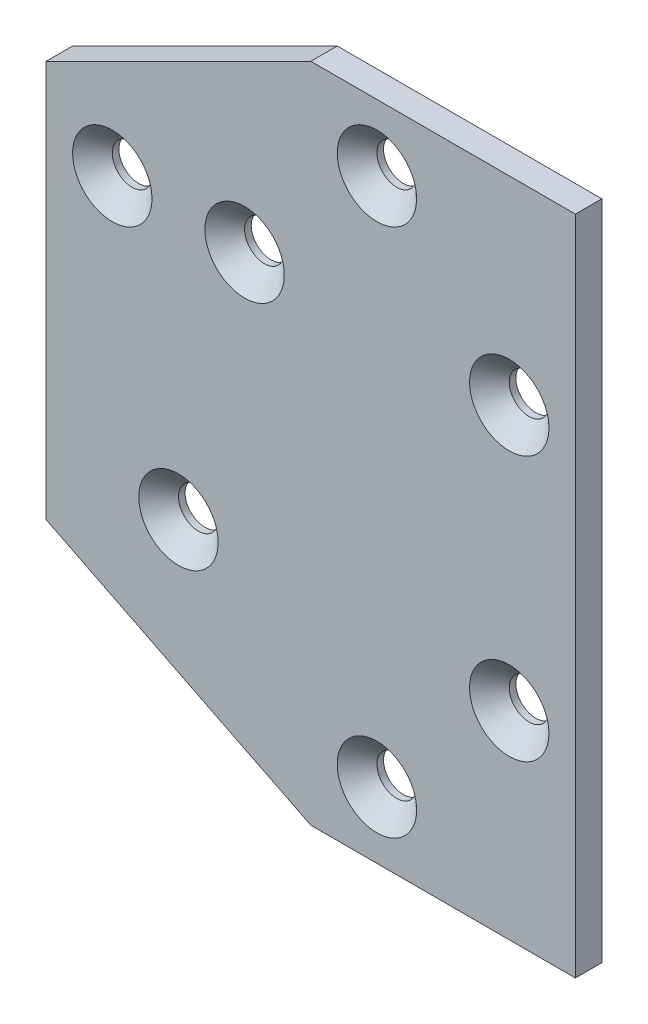
ISO-10303-21;
HEADER;
FILE_DESCRIPTION(('STEP AP214'),'2;1');
FILE_NAME('part.step','',(''),(''),'','','');
FILE_SCHEMA(('AUTOMOTIVE_DESIGN { 1 0 10303 214 1 1 1 1 }'));
ENDSEC;
DATA;
#1=APPLICATION_CONTEXT('core data for automotive mechanical design processes');
#2=APPLICATION_PROTOCOL_DEFINITION('international standard','automotive_design',2000,#1);
#3=PRODUCT_CONTEXT('',#1,'mechanical');
#4=PRODUCT('Part','Part','',(#3));
#5=PRODUCT_RELATED_PRODUCT_CATEGORY('part','',(#4));
#6=PRODUCT_DEFINITION_FORMATION('','',#4);
#7=PRODUCT_DEFINITION_CONTEXT('part definition',#1,'design');
#8=PRODUCT_DEFINITION('design','',#6,#7);
#9=PRODUCT_DEFINITION_SHAPE('','',#8);
#10=(LENGTH_UNIT() NAMED_UNIT(*) SI_UNIT(.MILLI.,.METRE.));
#11=(NAMED_UNIT(*) PLANE_ANGLE_UNIT() SI_UNIT($,.RADIAN.));
#12=(NAMED_UNIT(*) SI_UNIT($,.STERADIAN.) SOLID_ANGLE_UNIT());
#13=UNCERTAINTY_MEASURE_WITH_UNIT(LENGTH_MEASURE(1.E-05),#10,'distance_accuracy_value','');
#14=(GEOMETRIC_REPRESENTATION_CONTEXT(3) GLOBAL_UNCERTAINTY_ASSIGNED_CONTEXT((#13)) GLOBAL_UNIT_ASSIGNED_CONTEXT((#10,
#11,#12)) REPRESENTATION_CONTEXT('',''));
#15=CARTESIAN_POINT('',(0.,0.,0.));
#16=DIRECTION('',(0.,0.,1.));
#17=DIRECTION('',(1.,0.,0.));
#18=AXIS2_PLACEMENT_3D('',#15,#16,#17);
#19=CARTESIAN_POINT('',(120.,-50.,2.));
#20=DIRECTION('',(0.,1.,0.));
#21=DIRECTION('',(0.,0.,1.));
#22=AXIS2_PLACEMENT_3D('',#19,#20,#21);
#23=PLANE('',#22);
#24=DIRECTION('',(-1.,0.,0.));
#25=VECTOR('',#24,1.);
#26=CARTESIAN_POINT('',(120.,-50.,-2.));
#27=LINE('',#26,#25);
#28=CARTESIAN_POINT('',(140.,-50.,-2.));
#29=VERTEX_POINT('',#28);
#30=CARTESIAN_POINT('',(100.,-50.,-2.));
#31=VERTEX_POINT('',#30);
#32=EDGE_CURVE('E127',#29,#31,#27,.T.);
#33=ORIENTED_EDGE('',*,*,#32,.F.);
#34=DIRECTION('',(0.,0.,-1.));
#35=VECTOR('',#34,1.);
#36=CARTESIAN_POINT('',(140.,-50.,2.));
#37=LINE('',#36,#35);
#38=CARTESIAN_POINT('',(140.,-50.,2.));
#39=VERTEX_POINT('',#38);
#40=EDGE_CURVE('E126',#39,#29,#37,.T.);
#41=ORIENTED_EDGE('',*,*,#40,.F.);
#42=DIRECTION('',(-1.,0.,0.));
#43=VECTOR('',#42,1.);
#44=CARTESIAN_POINT('',(120.,-50.,2.));
#45=LINE('',#44,#43);
#46=CARTESIAN_POINT('',(100.,-50.,2.));
#47=VERTEX_POINT('',#46);
#48=EDGE_CURVE('E140',#39,#47,#45,.T.);
#49=ORIENTED_EDGE('',*,*,#48,.T.);
#50=DIRECTION('',(0.,0.,-1.));
#51=VECTOR('',#50,1.);
#52=CARTESIAN_POINT('',(100.,-50.,2.));
#53=LINE('',#52,#51);
#54=EDGE_CURVE('E147',#47,#31,#53,.T.);
#55=ORIENTED_EDGE('',*,*,#54,.T.);
#56=EDGE_LOOP('',(#33,#41,#49,#55));
#57=FACE_BOUND('',#56,.T.);
#58=ADVANCED_FACE('F43',(#57),#23,.F.);
#59=CARTESIAN_POINT('',(96.,-48.,2.));
#60=DIRECTION('',(0.447213595499958,0.894427190999916,0.));
#61=DIRECTION('',(0.894427190999916,-0.447213595499958,0.));
#62=AXIS2_PLACEMENT_3D('',#59,#60,#61);
#63=PLANE('',#62);
#64=DIRECTION('',(-0.894427190999916,0.447213595499958,0.));
#65=VECTOR('',#64,1.);
#66=CARTESIAN_POINT('',(96.,-48.,-2.));
#67=LINE('',#66,#65);
#68=CARTESIAN_POINT('',(60.,-30.,-2.));
#69=VERTEX_POINT('',#68);
#70=EDGE_CURVE('E129',#31,#69,#67,.T.);
#71=ORIENTED_EDGE('',*,*,#70,.F.);
#72=ORIENTED_EDGE('',*,*,#54,.F.);
#73=DIRECTION('',(-0.894427190999916,0.447213595499958,0.));
#74=VECTOR('',#73,1.);
#75=CARTESIAN_POINT('',(96.,-48.,2.));
#76=LINE('',#75,#74);
#77=CARTESIAN_POINT('',(60.,-30.,2.));
#78=VERTEX_POINT('',#77);
#79=EDGE_CURVE('E92',#47,#78,#76,.T.);
#80=ORIENTED_EDGE('',*,*,#79,.T.);
#81=DIRECTION('',(0.,0.,-1.));
#82=VECTOR('',#81,1.);
#83=CARTESIAN_POINT('',(60.,-30.,2.));
#84=LINE('',#83,#82);
#85=EDGE_CURVE('E144',#78,#69,#84,.T.);
#86=ORIENTED_EDGE('',*,*,#85,.T.);
#87=EDGE_LOOP('',(#71,#72,#80,#86));
#88=FACE_BOUND('',#87,.T.);
#89=ADVANCED_FACE('F213',(#88),#63,.F.);
#90=CARTESIAN_POINT('',(60.,0.,2.));
#91=DIRECTION('',(1.,0.,0.));
#92=DIRECTION('',(0.,0.,1.));
#93=AXIS2_PLACEMENT_3D('',#90,#91,#92);
#94=PLANE('',#93);
#95=DIRECTION('',(0.,1.,0.));
#96=VECTOR('',#95,1.);
#97=CARTESIAN_POINT('',(60.,0.,-2.));
#98=LINE('',#97,#96);
#99=CARTESIAN_POINT('',(60.,30.,-2.));
#100=VERTEX_POINT('',#99);
#101=EDGE_CURVE('E133',#69,#100,#98,.T.);
#102=ORIENTED_EDGE('',*,*,#101,.F.);
#103=ORIENTED_EDGE('',*,*,#85,.F.);
#104=DIRECTION('',(0.,1.,0.));
#105=VECTOR('',#104,1.);
#106=CARTESIAN_POINT('',(60.,0.,2.));
#107=LINE('',#106,#105);
#108=CARTESIAN_POINT('',(60.,30.,2.));
#109=VERTEX_POINT('',#108);
#110=EDGE_CURVE('E120',#78,#109,#107,.T.);
#111=ORIENTED_EDGE('',*,*,#110,.T.);
#112=DIRECTION('',(0.,0.,-1.));
#113=VECTOR('',#112,1.);
#114=CARTESIAN_POINT('',(60.,30.,2.));
#115=LINE('',#114,#113);
#116=EDGE_CURVE('E114',#109,#100,#115,.T.);
#117=ORIENTED_EDGE('',*,*,#116,.T.);
#118=EDGE_LOOP('',(#102,#103,#111,#117));
#119=FACE_BOUND('',#118,.T.);
#120=ADVANCED_FACE('F235',(#119),#94,.F.);
#121=CARTESIAN_POINT('',(96.,48.,2.));
#122=DIRECTION('',(-0.447213595499958,0.894427190999916,0.));
#123=DIRECTION('',(0.894427190999916,0.447213595499958,0.));
#124=AXIS2_PLACEMENT_3D('',#121,#122,#123);
#125=PLANE('',#124);
#126=DIRECTION('',(-0.894427190999916,-0.447213595499958,0.));
#127=VECTOR('',#126,1.);
#128=CARTESIAN_POINT('',(96.,48.,-2.));
#129=LINE('',#128,#127);
#130=CARTESIAN_POINT('',(100.,50.,-2.));
#131=VERTEX_POINT('',#130);
#132=EDGE_CURVE('E136',#131,#100,#129,.T.);
#133=ORIENTED_EDGE('',*,*,#132,.T.);
#134=ORIENTED_EDGE('',*,*,#116,.F.);
#135=DIRECTION('',(-0.894427190999916,-0.447213595499958,0.));
#136=VECTOR('',#135,1.);
#137=CARTESIAN_POINT('',(96.,48.,2.));
#138=LINE('',#137,#136);
#139=CARTESIAN_POINT('',(100.,50.,2.));
#140=VERTEX_POINT('',#139);
#141=EDGE_CURVE('E104',#140,#109,#138,.T.);
#142=ORIENTED_EDGE('',*,*,#141,.F.);
#143=DIRECTION('',(0.,0.,-1.));
#144=VECTOR('',#143,1.);
#145=CARTESIAN_POINT('',(100.,50.,2.));
#146=LINE('',#145,#144);
#147=EDGE_CURVE('E109',#140,#131,#146,.T.);
#148=ORIENTED_EDGE('',*,*,#147,.T.);
#149=EDGE_LOOP('',(#133,#134,#142,#148));
#150=FACE_BOUND('',#149,.T.);
#151=ADVANCED_FACE('F117',(#150),#125,.T.);
#152=CARTESIAN_POINT('',(120.,50.,2.));
#153=DIRECTION('',(0.,1.,0.));
#154=DIRECTION('',(0.,0.,1.));
#155=AXIS2_PLACEMENT_3D('',#152,#153,#154);
#156=PLANE('',#155);
#157=DIRECTION('',(-1.,0.,0.));
#158=VECTOR('',#157,1.);
#159=CARTESIAN_POINT('',(120.,50.,-2.));
#160=LINE('',#159,#158);
#161=CARTESIAN_POINT('',(140.,50.,-2.));
#162=VERTEX_POINT('',#161);
#163=EDGE_CURVE('E111',#162,#131,#160,.T.);
#164=ORIENTED_EDGE('',*,*,#163,.T.);
#165=ORIENTED_EDGE('',*,*,#147,.F.);
#166=DIRECTION('',(-1.,0.,0.));
#167=VECTOR('',#166,1.);
#168=CARTESIAN_POINT('',(120.,50.,2.));
#169=LINE('',#168,#167);
#170=CARTESIAN_POINT('',(140.,50.,2.));
#171=VERTEX_POINT('',#170);
#172=EDGE_CURVE('E100',#171,#140,#169,.T.);
#173=ORIENTED_EDGE('',*,*,#172,.F.);
#174=DIRECTION('',(0.,0.,-1.));
#175=VECTOR('',#174,1.);
#176=CARTESIAN_POINT('',(140.,50.,2.));
#177=LINE('',#176,#175);
#178=EDGE_CURVE('E115',#171,#162,#177,.T.);
#179=ORIENTED_EDGE('',*,*,#178,.T.);
#180=EDGE_LOOP('',(#164,#165,#173,#179));
#181=FACE_BOUND('',#180,.T.);
#182=ADVANCED_FACE('F110',(#181),#156,.T.);
#183=CARTESIAN_POINT('',(140.,0.,2.));
#184=DIRECTION('',(1.,0.,0.));
#185=DIRECTION('',(0.,0.,1.));
#186=AXIS2_PLACEMENT_3D('',#183,#184,#185);
#187=PLANE('',#186);
#188=DIRECTION('',(0.,1.,0.));
#189=VECTOR('',#188,1.);
#190=CARTESIAN_POINT('',(140.,0.,-2.));
#191=LINE('',#190,#189);
#192=EDGE_CURVE('E80',#29,#162,#191,.T.);
#193=ORIENTED_EDGE('',*,*,#192,.T.);
#194=ORIENTED_EDGE('',*,*,#178,.F.);
#195=DIRECTION('',(0.,1.,0.));
#196=VECTOR('',#195,1.);
#197=CARTESIAN_POINT('',(140.,0.,2.));
#198=LINE('',#197,#196);
#199=EDGE_CURVE('E60',#39,#171,#198,.T.);
#200=ORIENTED_EDGE('',*,*,#199,.F.);
#201=ORIENTED_EDGE('',*,*,#40,.T.);
#202=EDGE_LOOP('',(#193,#194,#200,#201));
#203=FACE_BOUND('',#202,.T.);
#204=ADVANCED_FACE('F218',(#203),#187,.T.);
#205=CARTESIAN_POINT('',(120.,0.,2.));
#206=DIRECTION('',(0.,0.,1.));
#207=DIRECTION('',(-1.,0.,0.));
#208=AXIS2_PLACEMENT_3D('',#205,#206,#207);
#209=PLANE('',#208);
#210=CARTESIAN_POINT('',(110.,-40.,2.));
#211=DIRECTION('',(0.,0.,-1.));
#212=DIRECTION('',(-1.,0.,0.));
#213=AXIS2_PLACEMENT_3D('',#210,#211,#212);
#214=CIRCLE('',#213,6.00000000000001);
#215=CARTESIAN_POINT('',(104.,-40.,2.));
#216=VERTEX_POINT('',#215);
#217=EDGE_CURVE('E171',#216,#216,#214,.F.);
#218=ORIENTED_EDGE('',*,*,#217,.F.);
#219=EDGE_LOOP('',(#218));
#220=FACE_BOUND('',#219,.T.);
#221=CARTESIAN_POINT('',(80.,-20.,2.));
#222=DIRECTION('',(0.,0.,-1.));
#223=DIRECTION('',(-1.,0.,0.));
#224=AXIS2_PLACEMENT_3D('',#221,#222,#223);
#225=CIRCLE('',#224,6.00000000000001);
#226=CARTESIAN_POINT('',(74.,-20.,2.));
#227=VERTEX_POINT('',#226);
#228=EDGE_CURVE('E168',#227,#227,#225,.F.);
#229=ORIENTED_EDGE('',*,*,#228,.F.);
#230=EDGE_LOOP('',(#229));
#231=FACE_BOUND('',#230,.T.);
#232=CARTESIAN_POINT('',(130.,-20.,2.));
#233=DIRECTION('',(0.,0.,-1.));
#234=DIRECTION('',(-1.,0.,0.));
#235=AXIS2_PLACEMENT_3D('',#232,#233,#234);
#236=CIRCLE('',#235,6.00000000000001);
#237=CARTESIAN_POINT('',(124.,-20.,2.));
#238=VERTEX_POINT('',#237);
#239=EDGE_CURVE('E165',#238,#238,#236,.F.);
#240=ORIENTED_EDGE('',*,*,#239,.F.);
#241=EDGE_LOOP('',(#240));
#242=FACE_BOUND('',#241,.T.);
#243=CARTESIAN_POINT('',(70.,20.,2.));
#244=DIRECTION('',(0.,0.,-1.));
#245=DIRECTION('',(-1.,0.,0.));
#246=AXIS2_PLACEMENT_3D('',#243,#244,#245);
#247=CIRCLE('',#246,6.00000000000001);
#248=CARTESIAN_POINT('',(64.,20.,2.));
#249=VERTEX_POINT('',#248);
#250=EDGE_CURVE('E162',#249,#249,#247,.F.);
#251=ORIENTED_EDGE('',*,*,#250,.F.);
#252=EDGE_LOOP('',(#251));
#253=FACE_BOUND('',#252,.T.);
#254=CARTESIAN_POINT('',(90.,20.,2.));
#255=DIRECTION('',(0.,0.,-1.));
#256=DIRECTION('',(-1.,0.,0.));
#257=AXIS2_PLACEMENT_3D('',#254,#255,#256);
#258=CIRCLE('',#257,6.00000000000001);
#259=CARTESIAN_POINT('',(84.,20.,2.));
#260=VERTEX_POINT('',#259);
#261=EDGE_CURVE('E159',#260,#260,#258,.F.);
#262=ORIENTED_EDGE('',*,*,#261,.F.);
#263=EDGE_LOOP('',(#262));
#264=FACE_BOUND('',#263,.T.);
#265=CARTESIAN_POINT('',(110.,40.,2.));
#266=DIRECTION('',(0.,0.,-1.));
#267=DIRECTION('',(-1.,0.,0.));
#268=AXIS2_PLACEMENT_3D('',#265,#266,#267);
#269=CIRCLE('',#268,6.00000000000001);
#270=CARTESIAN_POINT('',(104.,40.,2.));
#271=VERTEX_POINT('',#270);
#272=EDGE_CURVE('E156',#271,#271,#269,.F.);
#273=ORIENTED_EDGE('',*,*,#272,.F.);
#274=EDGE_LOOP('',(#273));
#275=FACE_BOUND('',#274,.T.);
#276=CARTESIAN_POINT('',(130.,20.,2.));
#277=DIRECTION('',(0.,0.,-1.));
#278=DIRECTION('',(-1.,0.,0.));
#279=AXIS2_PLACEMENT_3D('',#276,#277,#278);
#280=CIRCLE('',#279,6.);
#281=CARTESIAN_POINT('',(124.,20.,2.));
#282=VERTEX_POINT('',#281);
#283=EDGE_CURVE('E153',#282,#282,#280,.F.);
#284=ORIENTED_EDGE('',*,*,#283,.F.);
#285=EDGE_LOOP('',(#284));
#286=FACE_BOUND('',#285,.T.);
#287=ORIENTED_EDGE('',*,*,#48,.F.);
#288=ORIENTED_EDGE('',*,*,#199,.T.);
#289=ORIENTED_EDGE('',*,*,#172,.T.);
#290=ORIENTED_EDGE('',*,*,#141,.T.);
#291=ORIENTED_EDGE('',*,*,#110,.F.);
#292=ORIENTED_EDGE('',*,*,#79,.F.);
#293=EDGE_LOOP('',(#287,#288,#289,#290,#291,#292));
#294=FACE_BOUND('',#293,.T.);
#295=ADVANCED_FACE('F102',(#220,#231,#242,#253,#264,#275,#286,#294),#209,.T.);
#296=CARTESIAN_POINT('',(120.,0.,-2.));
#297=DIRECTION('',(0.,0.,1.));
#298=DIRECTION('',(-1.,0.,0.));
#299=AXIS2_PLACEMENT_3D('',#296,#297,#298);
#300=PLANE('',#299);
#301=CARTESIAN_POINT('',(80.,-20.,-2.));
#302=DIRECTION('',(0.,0.,-1.));
#303=DIRECTION('',(-1.,0.,0.));
#304=AXIS2_PLACEMENT_3D('',#301,#302,#303);
#305=CIRCLE('',#304,3.);
#306=CARTESIAN_POINT('',(77.,-20.,-2.));
#307=VERTEX_POINT('',#306);
#308=EDGE_CURVE('E208',#307,#307,#305,.T.);
#309=ORIENTED_EDGE('',*,*,#308,.F.);
#310=EDGE_LOOP('',(#309));
#311=FACE_BOUND('',#310,.T.);
#312=CARTESIAN_POINT('',(110.,-40.,-2.));
#313=DIRECTION('',(0.,0.,-1.));
#314=DIRECTION('',(-1.,0.,0.));
#315=AXIS2_PLACEMENT_3D('',#312,#313,#314);
#316=CIRCLE('',#315,3.);
#317=CARTESIAN_POINT('',(107.,-40.,-2.));
#318=VERTEX_POINT('',#317);
#319=EDGE_CURVE('E205',#318,#318,#316,.T.);
#320=ORIENTED_EDGE('',*,*,#319,.F.);
#321=EDGE_LOOP('',(#320));
#322=FACE_BOUND('',#321,.T.);
#323=CARTESIAN_POINT('',(130.,-20.,-2.));
#324=DIRECTION('',(0.,0.,-1.));
#325=DIRECTION('',(-1.,0.,0.));
#326=AXIS2_PLACEMENT_3D('',#323,#324,#325);
#327=CIRCLE('',#326,3.);
#328=CARTESIAN_POINT('',(127.,-20.,-2.));
#329=VERTEX_POINT('',#328);
#330=EDGE_CURVE('E200',#329,#329,#327,.T.);
#331=ORIENTED_EDGE('',*,*,#330,.F.);
#332=EDGE_LOOP('',(#331));
#333=FACE_BOUND('',#332,.T.);
#334=CARTESIAN_POINT('',(110.,40.,-2.));
#335=DIRECTION('',(0.,0.,-1.));
#336=DIRECTION('',(-1.,0.,0.));
#337=AXIS2_PLACEMENT_3D('',#334,#335,#336);
#338=CIRCLE('',#337,3.);
#339=CARTESIAN_POINT('',(107.,40.,-2.));
#340=VERTEX_POINT('',#339);
#341=EDGE_CURVE('E198',#340,#340,#338,.T.);
#342=ORIENTED_EDGE('',*,*,#341,.F.);
#343=EDGE_LOOP('',(#342));
#344=FACE_BOUND('',#343,.T.);
#345=CARTESIAN_POINT('',(90.,20.,-2.));
#346=DIRECTION('',(0.,0.,-1.));
#347=DIRECTION('',(-1.,0.,0.));
#348=AXIS2_PLACEMENT_3D('',#345,#346,#347);
#349=CIRCLE('',#348,3.);
#350=CARTESIAN_POINT('',(87.,20.,-2.));
#351=VERTEX_POINT('',#350);
#352=EDGE_CURVE('E493',#351,#351,#349,.T.);
#353=ORIENTED_EDGE('',*,*,#352,.F.);
#354=EDGE_LOOP('',(#353));
#355=FACE_BOUND('',#354,.T.);
#356=CARTESIAN_POINT('',(70.,20.,-2.));
#357=DIRECTION('',(0.,0.,-1.));
#358=DIRECTION('',(-1.,0.,0.));
#359=AXIS2_PLACEMENT_3D('',#356,#357,#358);
#360=CIRCLE('',#359,3.);
#361=CARTESIAN_POINT('',(67.,20.,-2.));
#362=VERTEX_POINT('',#361);
#363=EDGE_CURVE('E496',#362,#362,#360,.T.);
#364=ORIENTED_EDGE('',*,*,#363,.F.);
#365=EDGE_LOOP('',(#364));
#366=FACE_BOUND('',#365,.T.);
#367=CARTESIAN_POINT('',(130.,20.,-2.));
#368=DIRECTION('',(0.,0.,-1.));
#369=DIRECTION('',(-1.,0.,0.));
#370=AXIS2_PLACEMENT_3D('',#367,#368,#369);
#371=CIRCLE('',#370,3.);
#372=CARTESIAN_POINT('',(127.,20.,-2.));
#373=VERTEX_POINT('',#372);
#374=EDGE_CURVE('E130',#373,#373,#371,.T.);
#375=ORIENTED_EDGE('',*,*,#374,.F.);
#376=EDGE_LOOP('',(#375));
#377=FACE_BOUND('',#376,.T.);
#378=ORIENTED_EDGE('',*,*,#32,.T.);
#379=ORIENTED_EDGE('',*,*,#70,.T.);
#380=ORIENTED_EDGE('',*,*,#101,.T.);
#381=ORIENTED_EDGE('',*,*,#132,.F.);
#382=ORIENTED_EDGE('',*,*,#163,.F.);
#383=ORIENTED_EDGE('',*,*,#192,.F.);
#384=EDGE_LOOP('',(#378,#379,#380,#381,#382,#383));
#385=FACE_BOUND('',#384,.T.);
#386=ADVANCED_FACE('F225',(#311,#322,#333,#344,#355,#366,#377,#385),#300,.F.);
#387=CARTESIAN_POINT('',(130.,20.,-2.));
#388=DIRECTION('',(0.,0.,1.));
#389=DIRECTION('',(-1.,0.,0.));
#390=AXIS2_PLACEMENT_3D('',#387,#388,#389);
#391=CYLINDRICAL_SURFACE('',#390,3.);
#392=CARTESIAN_POINT('',(130.,20.,-1.));
#393=DIRECTION('',(0.,0.,-1.));
#394=DIRECTION('',(-1.,0.,0.));
#395=AXIS2_PLACEMENT_3D('',#392,#393,#394);
#396=CIRCLE('',#395,3.);
#397=CARTESIAN_POINT('',(127.,20.,-1.));
#398=VERTEX_POINT('',#397);
#399=EDGE_CURVE('E11',#398,#398,#396,.T.);
#400=ORIENTED_EDGE('',*,*,#399,.F.);
#401=EDGE_LOOP('',(#400));
#402=FACE_BOUND('',#401,.T.);
#403=ORIENTED_EDGE('',*,*,#374,.T.);
#404=EDGE_LOOP('',(#403));
#405=FACE_BOUND('',#404,.T.);
#406=ADVANCED_FACE('F272',(#402,#405),#391,.F.);
#407=CARTESIAN_POINT('',(70.,20.,-2.));
#408=DIRECTION('',(0.,0.,1.));
#409=DIRECTION('',(-1.,0.,0.));
#410=AXIS2_PLACEMENT_3D('',#407,#408,#409);
#411=CYLINDRICAL_SURFACE('',#410,3.);
#412=CARTESIAN_POINT('',(70.,20.,-1.));
#413=DIRECTION('',(0.,0.,-1.));
#414=DIRECTION('',(-1.,0.,0.));
#415=AXIS2_PLACEMENT_3D('',#412,#413,#414);
#416=CIRCLE('',#415,3.);
#417=CARTESIAN_POINT('',(67.,20.,-1.));
#418=VERTEX_POINT('',#417);
#419=EDGE_CURVE('E180',#418,#418,#416,.T.);
#420=ORIENTED_EDGE('',*,*,#419,.F.);
#421=EDGE_LOOP('',(#420));
#422=FACE_BOUND('',#421,.T.);
#423=ORIENTED_EDGE('',*,*,#363,.T.);
#424=EDGE_LOOP('',(#423));
#425=FACE_BOUND('',#424,.T.);
#426=ADVANCED_FACE('F275',(#422,#425),#411,.F.);
#427=CARTESIAN_POINT('',(90.,20.,-2.));
#428=DIRECTION('',(0.,0.,1.));
#429=DIRECTION('',(-1.,0.,0.));
#430=AXIS2_PLACEMENT_3D('',#427,#428,#429);
#431=CYLINDRICAL_SURFACE('',#430,3.);
#432=CARTESIAN_POINT('',(90.,20.,-1.));
#433=DIRECTION('',(0.,0.,-1.));
#434=DIRECTION('',(-1.,0.,0.));
#435=AXIS2_PLACEMENT_3D('',#432,#433,#434);
#436=CIRCLE('',#435,3.);
#437=CARTESIAN_POINT('',(87.,20.,-1.));
#438=VERTEX_POINT('',#437);
#439=EDGE_CURVE('E183',#438,#438,#436,.T.);
#440=ORIENTED_EDGE('',*,*,#439,.F.);
#441=EDGE_LOOP('',(#440));
#442=FACE_BOUND('',#441,.T.);
#443=ORIENTED_EDGE('',*,*,#352,.T.);
#444=EDGE_LOOP('',(#443));
#445=FACE_BOUND('',#444,.T.);
#446=ADVANCED_FACE('F194',(#442,#445),#431,.F.);
#447=CARTESIAN_POINT('',(110.,40.,-2.));
#448=DIRECTION('',(0.,0.,1.));
#449=DIRECTION('',(-1.,0.,0.));
#450=AXIS2_PLACEMENT_3D('',#447,#448,#449);
#451=CYLINDRICAL_SURFACE('',#450,3.);
#452=CARTESIAN_POINT('',(110.,40.,-1.));
#453=DIRECTION('',(0.,0.,-1.));
#454=DIRECTION('',(-1.,0.,0.));
#455=AXIS2_PLACEMENT_3D('',#452,#453,#454);
#456=CIRCLE('',#455,3.);
#457=CARTESIAN_POINT('',(107.,40.,-1.));
#458=VERTEX_POINT('',#457);
#459=EDGE_CURVE('E52',#458,#458,#456,.T.);
#460=ORIENTED_EDGE('',*,*,#459,.F.);
#461=EDGE_LOOP('',(#460));
#462=FACE_BOUND('',#461,.T.);
#463=ORIENTED_EDGE('',*,*,#341,.T.);
#464=EDGE_LOOP('',(#463));
#465=FACE_BOUND('',#464,.T.);
#466=ADVANCED_FACE('F190',(#462,#465),#451,.F.);
#467=CARTESIAN_POINT('',(130.,-20.,-2.));
#468=DIRECTION('',(0.,0.,1.));
#469=DIRECTION('',(-1.,0.,0.));
#470=AXIS2_PLACEMENT_3D('',#467,#468,#469);
#471=CYLINDRICAL_SURFACE('',#470,3.);
#472=CARTESIAN_POINT('',(130.,-20.,-1.));
#473=DIRECTION('',(0.,0.,-1.));
#474=DIRECTION('',(-1.,0.,0.));
#475=AXIS2_PLACEMENT_3D('',#472,#473,#474);
#476=CIRCLE('',#475,3.);
#477=CARTESIAN_POINT('',(127.,-20.,-1.));
#478=VERTEX_POINT('',#477);
#479=EDGE_CURVE('E177',#478,#478,#476,.T.);
#480=ORIENTED_EDGE('',*,*,#479,.F.);
#481=EDGE_LOOP('',(#480));
#482=FACE_BOUND('',#481,.T.);
#483=ORIENTED_EDGE('',*,*,#330,.T.);
#484=EDGE_LOOP('',(#483));
#485=FACE_BOUND('',#484,.T.);
#486=ADVANCED_FACE('F193',(#482,#485),#471,.F.);
#487=CARTESIAN_POINT('',(110.,-40.,-2.));
#488=DIRECTION('',(0.,0.,1.));
#489=DIRECTION('',(-1.,0.,0.));
#490=AXIS2_PLACEMENT_3D('',#487,#488,#489);
#491=CYLINDRICAL_SURFACE('',#490,3.);
#492=CARTESIAN_POINT('',(110.,-40.,-1.));
#493=DIRECTION('',(0.,0.,-1.));
#494=DIRECTION('',(-1.,0.,0.));
#495=AXIS2_PLACEMENT_3D('',#492,#493,#494);
#496=CIRCLE('',#495,3.);
#497=CARTESIAN_POINT('',(107.,-40.,-1.));
#498=VERTEX_POINT('',#497);
#499=EDGE_CURVE('E150',#498,#498,#496,.T.);
#500=ORIENTED_EDGE('',*,*,#499,.F.);
#501=EDGE_LOOP('',(#500));
#502=FACE_BOUND('',#501,.T.);
#503=ORIENTED_EDGE('',*,*,#319,.T.);
#504=EDGE_LOOP('',(#503));
#505=FACE_BOUND('',#504,.T.);
#506=ADVANCED_FACE('F378',(#502,#505),#491,.F.);
#507=CARTESIAN_POINT('',(80.,-20.,-2.));
#508=DIRECTION('',(0.,0.,1.));
#509=DIRECTION('',(-1.,0.,0.));
#510=AXIS2_PLACEMENT_3D('',#507,#508,#509);
#511=CYLINDRICAL_SURFACE('',#510,3.);
#512=CARTESIAN_POINT('',(80.,-20.,-1.));
#513=DIRECTION('',(0.,0.,-1.));
#514=DIRECTION('',(-1.,0.,0.));
#515=AXIS2_PLACEMENT_3D('',#512,#513,#514);
#516=CIRCLE('',#515,3.);
#517=CARTESIAN_POINT('',(77.,-20.,-1.));
#518=VERTEX_POINT('',#517);
#519=EDGE_CURVE('E174',#518,#518,#516,.T.);
#520=ORIENTED_EDGE('',*,*,#519,.F.);
#521=EDGE_LOOP('',(#520));
#522=FACE_BOUND('',#521,.T.);
#523=ORIENTED_EDGE('',*,*,#308,.T.);
#524=EDGE_LOOP('',(#523));
#525=FACE_BOUND('',#524,.T.);
#526=ADVANCED_FACE('F243',(#522,#525),#511,.F.);
#527=CARTESIAN_POINT('',(110.,-40.,-1.));
#528=DIRECTION('',(0.,0.,1.));
#529=DIRECTION('',(-1.,0.,0.));
#530=AXIS2_PLACEMENT_3D('',#527,#528,#529);
#531=CONICAL_SURFACE('',#530,3.,0.785398163397449);
#532=ORIENTED_EDGE('',*,*,#217,.T.);
#533=EDGE_LOOP('',(#532));
#534=FACE_BOUND('',#533,.T.);
#535=ORIENTED_EDGE('',*,*,#499,.T.);
#536=EDGE_LOOP('',(#535));
#537=FACE_BOUND('',#536,.T.);
#538=ADVANCED_FACE('F239',(#534,#537),#531,.F.);
#539=CARTESIAN_POINT('',(80.,-20.,-1.));
#540=DIRECTION('',(0.,0.,1.));
#541=DIRECTION('',(-1.,0.,0.));
#542=AXIS2_PLACEMENT_3D('',#539,#540,#541);
#543=CONICAL_SURFACE('',#542,3.,0.785398163397449);
#544=CARTESIAN_POINT('',(74.,-20.,2.));
#545=CARTESIAN_POINT('',(74.03125,-20.,1.96875));
#546=CARTESIAN_POINT('',(74.0625,-20.,1.9375));
#547=CARTESIAN_POINT('',(74.125,-20.,1.875));
#548=CARTESIAN_POINT('',(74.15625,-20.,1.84375));
#549=CARTESIAN_POINT('',(74.21875,-20.,1.78125));
#550=CARTESIAN_POINT('',(74.25,-20.,1.75));
#551=CARTESIAN_POINT('',(74.3125,-20.,1.6875));
#552=CARTESIAN_POINT('',(74.34375,-20.,1.65625));
#553=CARTESIAN_POINT('',(74.40625,-20.,1.59375));
#554=CARTESIAN_POINT('',(74.4375,-20.,1.5625));
#555=CARTESIAN_POINT('',(74.5,-20.,1.5));
#556=CARTESIAN_POINT('',(74.53125,-20.,1.46875));
#557=CARTESIAN_POINT('',(74.59375,-20.,1.40625));
#558=CARTESIAN_POINT('',(74.625,-20.,1.375));
#559=CARTESIAN_POINT('',(74.6875,-20.,1.3125));
#560=CARTESIAN_POINT('',(74.71875,-20.,1.28125));
#561=CARTESIAN_POINT('',(74.78125,-20.,1.21875));
#562=CARTESIAN_POINT('',(74.8125,-20.,1.1875));
#563=CARTESIAN_POINT('',(74.875,-20.,1.125));
#564=CARTESIAN_POINT('',(74.90625,-20.,1.09375));
#565=CARTESIAN_POINT('',(74.96875,-20.,1.03125));
#566=CARTESIAN_POINT('',(75.,-20.,1.));
#567=CARTESIAN_POINT('',(75.0625,-20.,0.9375));
#568=CARTESIAN_POINT('',(75.09375,-20.,0.90625));
#569=CARTESIAN_POINT('',(75.15625,-20.,0.84375));
#570=CARTESIAN_POINT('',(75.1875,-20.,0.812499999999999));
#571=CARTESIAN_POINT('',(75.25,-20.,0.75));
#572=CARTESIAN_POINT('',(75.28125,-20.,0.718750000000001));
#573=CARTESIAN_POINT('',(75.34375,-20.,0.656250000000001));
#574=CARTESIAN_POINT('',(75.375,-20.,0.624999999999999));
#575=CARTESIAN_POINT('',(75.4375,-20.,0.562499999999998));
#576=CARTESIAN_POINT('',(75.46875,-20.,0.531249999999999));
#577=CARTESIAN_POINT('',(75.53125,-20.,0.46875));
#578=CARTESIAN_POINT('',(75.5625,-20.,0.437499999999999));
#579=CARTESIAN_POINT('',(75.625,-20.,0.375));
#580=CARTESIAN_POINT('',(75.65625,-20.,0.343750000000001));
#581=CARTESIAN_POINT('',(75.71875,-20.,0.28125));
#582=CARTESIAN_POINT('',(75.75,-20.,0.249999999999999));
#583=CARTESIAN_POINT('',(75.8125,-20.,0.187499999999998));
#584=CARTESIAN_POINT('',(75.84375,-20.,0.156249999999999));
#585=CARTESIAN_POINT('',(75.90625,-20.,0.09375));
#586=CARTESIAN_POINT('',(75.9375,-20.,0.0624999999999995));
#587=CARTESIAN_POINT('',(76.,-20.,0.));
#588=CARTESIAN_POINT('',(76.03125,-20.,-0.0312499999999987));
#589=CARTESIAN_POINT('',(76.09375,-20.,-0.0937499999999993));
#590=CARTESIAN_POINT('',(76.125,-20.,-0.125000000000001));
#591=CARTESIAN_POINT('',(76.1875,-20.,-0.187500000000002));
#592=CARTESIAN_POINT('',(76.21875,-20.,-0.218750000000001));
#593=CARTESIAN_POINT('',(76.28125,-20.,-0.28125));
#594=CARTESIAN_POINT('',(76.3125,-20.,-0.312500000000001));
#595=CARTESIAN_POINT('',(76.375,-20.,-0.375));
#596=CARTESIAN_POINT('',(76.40625,-20.,-0.406249999999999));
#597=CARTESIAN_POINT('',(76.46875,-20.,-0.46875));
#598=CARTESIAN_POINT('',(76.5,-20.,-0.500000000000001));
#599=CARTESIAN_POINT('',(76.5625,-20.,-0.562500000000002));
#600=CARTESIAN_POINT('',(76.59375,-20.,-0.593750000000001));
#601=CARTESIAN_POINT('',(76.65625,-20.,-0.65625));
#602=CARTESIAN_POINT('',(76.6875,-20.,-0.6875));
#603=CARTESIAN_POINT('',(76.75,-20.,-0.75));
#604=CARTESIAN_POINT('',(76.78125,-20.,-0.781249999999999));
#605=CARTESIAN_POINT('',(76.84375,-20.,-0.843749999999999));
#606=CARTESIAN_POINT('',(76.875,-20.,-0.875));
#607=CARTESIAN_POINT('',(76.9375,-20.,-0.937500000000003));
#608=CARTESIAN_POINT('',(76.96875,-20.,-0.968750000000004));
#609=CARTESIAN_POINT('',(77.,-20.,-1.));
#610=B_SPLINE_CURVE_WITH_KNOTS('',3,(#544,#545,#546,#547,#548,#549,#550,#551,#552,#553,#554,
#555,#556,#557,#558,#559,#560,#561,#562,#563,#564,#565,#566,#567,#568,#569,#570,#571,#572,#573,
#574,#575,#576,#577,#578,#579,#580,#581,#582,#583,#584,#585,#586,#587,#588,#589,#590,#591,#592,
#593,#594,#595,#596,#597,#598,#599,#600,#601,#602,#603,#604,#605,#606,#607,#608,#609),
.UNSPECIFIED.,.F.,.F.,(4,2,2,2,2,2,2,2,2,2,2,2,2,2,2,2,2,2,2,2,2,2,2,2,2,2,2,2,2,2,2,2,4),(0.,
0.13258252147248,0.265165042944951,0.397747564417431,0.530330085889911,0.662912607362391,
0.795495128834871,0.928077650307342,1.06066017177982,1.1932426932523,1.32582521472477,
1.45840773619725,1.59099025766973,1.72357277914221,1.85615530061469,1.98873782208716,
2.12132034355964,2.25390286503212,2.3864853865046,2.51906790797707,2.65165042944955,
2.78423295092203,2.91681547239452,3.04939799386699,3.18198051533947,3.31456303681195,
3.44714555828443,3.5797280797569,3.71231060122938,3.84489312270186,3.97747564417434,
4.11005816564681,4.24264068711929),.UNSPECIFIED.);
#611=EDGE_CURVE('BSEAM242',#227,#518,#610,.T.);
#612=ORIENTED_EDGE('',*,*,#228,.T.);
#613=ORIENTED_EDGE('',*,*,#519,.T.);
#614=ORIENTED_EDGE('',*,*,#611,.T.);
#615=ORIENTED_EDGE('',*,*,#611,.F.);
#616=EDGE_LOOP('',(#612,#614,#613,#615));
#617=FACE_BOUND('',#616,.T.);
#618=ADVANCED_FACE('F242',(#617),#543,.F.);
#619=CARTESIAN_POINT('',(130.,-20.,-1.));
#620=DIRECTION('',(0.,0.,1.));
#621=DIRECTION('',(-1.,0.,0.));
#622=AXIS2_PLACEMENT_3D('',#619,#620,#621);
#623=CONICAL_SURFACE('',#622,3.,0.785398163397449);
#624=ORIENTED_EDGE('',*,*,#239,.T.);
#625=EDGE_LOOP('',(#624));
#626=FACE_BOUND('',#625,.T.);
#627=ORIENTED_EDGE('',*,*,#479,.T.);
#628=EDGE_LOOP('',(#627));
#629=FACE_BOUND('',#628,.T.);
#630=ADVANCED_FACE('F247',(#626,#629),#623,.F.);
#631=CARTESIAN_POINT('',(70.,20.,-1.));
#632=DIRECTION('',(0.,0.,1.));
#633=DIRECTION('',(-1.,0.,0.));
#634=AXIS2_PLACEMENT_3D('',#631,#632,#633);
#635=CONICAL_SURFACE('',#634,3.,0.785398163397449);
#636=CARTESIAN_POINT('',(64.,20.,2.));
#637=CARTESIAN_POINT('',(64.03125,20.,1.96875));
#638=CARTESIAN_POINT('',(64.0625,20.,1.9375));
#639=CARTESIAN_POINT('',(64.125,20.,1.875));
#640=CARTESIAN_POINT('',(64.15625,20.,1.84375));
#641=CARTESIAN_POINT('',(64.21875,20.,1.78125));
#642=CARTESIAN_POINT('',(64.25,20.,1.75));
#643=CARTESIAN_POINT('',(64.3125,20.,1.6875));
#644=CARTESIAN_POINT('',(64.34375,20.,1.65625));
#645=CARTESIAN_POINT('',(64.40625,20.,1.59375));
#646=CARTESIAN_POINT('',(64.4375,20.,1.5625));
#647=CARTESIAN_POINT('',(64.5,20.,1.5));
#648=CARTESIAN_POINT('',(64.53125,20.,1.46875));
#649=CARTESIAN_POINT('',(64.59375,20.,1.40625));
#650=CARTESIAN_POINT('',(64.625,20.,1.375));
#651=CARTESIAN_POINT('',(64.6875,20.,1.3125));
#652=CARTESIAN_POINT('',(64.71875,20.,1.28125));
#653=CARTESIAN_POINT('',(64.78125,20.,1.21875));
#654=CARTESIAN_POINT('',(64.8125,20.,1.1875));
#655=CARTESIAN_POINT('',(64.875,20.,1.125));
#656=CARTESIAN_POINT('',(64.90625,20.,1.09375));
#657=CARTESIAN_POINT('',(64.96875,20.,1.03125));
#658=CARTESIAN_POINT('',(65.,20.,1.));
#659=CARTESIAN_POINT('',(65.0625,20.,0.9375));
#660=CARTESIAN_POINT('',(65.09375,20.,0.90625));
#661=CARTESIAN_POINT('',(65.15625,20.,0.84375));
#662=CARTESIAN_POINT('',(65.1875,20.,0.812499999999999));
#663=CARTESIAN_POINT('',(65.25,20.,0.75));
#664=CARTESIAN_POINT('',(65.28125,20.,0.718750000000001));
#665=CARTESIAN_POINT('',(65.34375,20.,0.656250000000001));
#666=CARTESIAN_POINT('',(65.375,20.,0.624999999999999));
#667=CARTESIAN_POINT('',(65.4375,20.,0.562499999999998));
#668=CARTESIAN_POINT('',(65.46875,20.,0.531249999999999));
#669=CARTESIAN_POINT('',(65.53125,20.,0.46875));
#670=CARTESIAN_POINT('',(65.5625,20.,0.437499999999999));
#671=CARTESIAN_POINT('',(65.625,20.,0.375));
#672=CARTESIAN_POINT('',(65.65625,20.,0.343750000000001));
#673=CARTESIAN_POINT('',(65.71875,20.,0.28125));
#674=CARTESIAN_POINT('',(65.75,20.,0.249999999999999));
#675=CARTESIAN_POINT('',(65.8125,20.,0.187499999999998));
#676=CARTESIAN_POINT('',(65.84375,20.,0.156249999999999));
#677=CARTESIAN_POINT('',(65.90625,20.,0.09375));
#678=CARTESIAN_POINT('',(65.9375,20.,0.0624999999999995));
#679=CARTESIAN_POINT('',(66.,20.,0.));
#680=CARTESIAN_POINT('',(66.03125,20.,-0.0312499999999987));
#681=CARTESIAN_POINT('',(66.09375,20.,-0.0937499999999993));
#682=CARTESIAN_POINT('',(66.125,20.,-0.125000000000001));
#683=CARTESIAN_POINT('',(66.1875,20.,-0.187500000000002));
#684=CARTESIAN_POINT('',(66.21875,20.,-0.218750000000001));
#685=CARTESIAN_POINT('',(66.28125,20.,-0.28125));
#686=CARTESIAN_POINT('',(66.3125,20.,-0.312500000000001));
#687=CARTESIAN_POINT('',(66.375,20.,-0.375));
#688=CARTESIAN_POINT('',(66.40625,20.,-0.406249999999999));
#689=CARTESIAN_POINT('',(66.46875,20.,-0.46875));
#690=CARTESIAN_POINT('',(66.5,20.,-0.500000000000001));
#691=CARTESIAN_POINT('',(66.5625,20.,-0.562500000000002));
#692=CARTESIAN_POINT('',(66.59375,20.,-0.593750000000001));
#693=CARTESIAN_POINT('',(66.65625,20.,-0.65625));
#694=CARTESIAN_POINT('',(66.6875,20.,-0.6875));
#695=CARTESIAN_POINT('',(66.75,20.,-0.75));
#696=CARTESIAN_POINT('',(66.78125,20.,-0.781249999999999));
#697=CARTESIAN_POINT('',(66.84375,20.,-0.843749999999999));
#698=CARTESIAN_POINT('',(66.875,20.,-0.875));
#699=CARTESIAN_POINT('',(66.9375,20.,-0.937500000000003));
#700=CARTESIAN_POINT('',(66.96875,20.,-0.968750000000004));
#701=CARTESIAN_POINT('',(67.,20.,-1.));
#702=B_SPLINE_CURVE_WITH_KNOTS('',3,(#636,#637,#638,#639,#640,#641,#642,#643,#644,#645,#646,
#647,#648,#649,#650,#651,#652,#653,#654,#655,#656,#657,#658,#659,#660,#661,#662,#663,#664,#665,
#666,#667,#668,#669,#670,#671,#672,#673,#674,#675,#676,#677,#678,#679,#680,#681,#682,#683,#684,
#685,#686,#687,#688,#689,#690,#691,#692,#693,#694,#695,#696,#697,#698,#699,#700,#701),
.UNSPECIFIED.,.F.,.F.,(4,2,2,2,2,2,2,2,2,2,2,2,2,2,2,2,2,2,2,2,2,2,2,2,2,2,2,2,2,2,2,2,4),(0.,
0.13258252147248,0.265165042944951,0.397747564417431,0.530330085889911,0.662912607362391,
0.795495128834871,0.928077650307342,1.06066017177982,1.1932426932523,1.32582521472477,
1.45840773619725,1.59099025766973,1.72357277914221,1.85615530061469,1.98873782208716,
2.12132034355964,2.25390286503212,2.3864853865046,2.51906790797707,2.65165042944955,
2.78423295092203,2.91681547239452,3.04939799386699,3.18198051533947,3.31456303681195,
3.44714555828443,3.5797280797569,3.71231060122938,3.84489312270186,3.97747564417434,
4.11005816564681,4.24264068711929),.UNSPECIFIED.);
#703=EDGE_CURVE('BSEAM251',#249,#418,#702,.T.);
#704=ORIENTED_EDGE('',*,*,#250,.T.);
#705=ORIENTED_EDGE('',*,*,#419,.T.);
#706=ORIENTED_EDGE('',*,*,#703,.T.);
#707=ORIENTED_EDGE('',*,*,#703,.F.);
#708=EDGE_LOOP('',(#704,#706,#705,#707));
#709=FACE_BOUND('',#708,.T.);
#710=ADVANCED_FACE('F251',(#709),#635,.F.);
#711=CARTESIAN_POINT('',(90.,20.,-1.));
#712=DIRECTION('',(0.,0.,1.));
#713=DIRECTION('',(-1.,0.,0.));
#714=AXIS2_PLACEMENT_3D('',#711,#712,#713);
#715=CONICAL_SURFACE('',#714,3.,0.785398163397449);
#716=CARTESIAN_POINT('',(84.,20.,2.));
#717=CARTESIAN_POINT('',(84.03125,20.,1.96875));
#718=CARTESIAN_POINT('',(84.0625,20.,1.9375));
#719=CARTESIAN_POINT('',(84.125,20.,1.875));
#720=CARTESIAN_POINT('',(84.15625,20.,1.84375));
#721=CARTESIAN_POINT('',(84.21875,20.,1.78125));
#722=CARTESIAN_POINT('',(84.25,20.,1.75));
#723=CARTESIAN_POINT('',(84.3125,20.,1.6875));
#724=CARTESIAN_POINT('',(84.34375,20.,1.65625));
#725=CARTESIAN_POINT('',(84.40625,20.,1.59375));
#726=CARTESIAN_POINT('',(84.4375,20.,1.5625));
#727=CARTESIAN_POINT('',(84.5,20.,1.5));
#728=CARTESIAN_POINT('',(84.53125,20.,1.46875));
#729=CARTESIAN_POINT('',(84.59375,20.,1.40625));
#730=CARTESIAN_POINT('',(84.625,20.,1.375));
#731=CARTESIAN_POINT('',(84.6875,20.,1.3125));
#732=CARTESIAN_POINT('',(84.71875,20.,1.28125));
#733=CARTESIAN_POINT('',(84.78125,20.,1.21875));
#734=CARTESIAN_POINT('',(84.8125,20.,1.1875));
#735=CARTESIAN_POINT('',(84.875,20.,1.125));
#736=CARTESIAN_POINT('',(84.90625,20.,1.09375));
#737=CARTESIAN_POINT('',(84.96875,20.,1.03125));
#738=CARTESIAN_POINT('',(85.,20.,0.999999999999999));
#739=CARTESIAN_POINT('',(85.0625,20.,0.937499999999998));
#740=CARTESIAN_POINT('',(85.09375,20.,0.906249999999999));
#741=CARTESIAN_POINT('',(85.15625,20.,0.843750000000001));
#742=CARTESIAN_POINT('',(85.1875,20.,0.812500000000001));
#743=CARTESIAN_POINT('',(85.25,20.,0.750000000000001));
#744=CARTESIAN_POINT('',(85.28125,20.,0.718749999999999));
#745=CARTESIAN_POINT('',(85.34375,20.,0.656249999999999));
#746=CARTESIAN_POINT('',(85.375,20.,0.624999999999999));
#747=CARTESIAN_POINT('',(85.4375,20.,0.5625));
#748=CARTESIAN_POINT('',(85.46875,20.,0.53125));
#749=CARTESIAN_POINT('',(85.53125,20.,0.46875));
#750=CARTESIAN_POINT('',(85.5625,20.,0.437499999999999));
#751=CARTESIAN_POINT('',(85.625,20.,0.375));
#752=CARTESIAN_POINT('',(85.65625,20.,0.343750000000001));
#753=CARTESIAN_POINT('',(85.71875,20.,0.28125));
#754=CARTESIAN_POINT('',(85.75,20.,0.249999999999999));
#755=CARTESIAN_POINT('',(85.8125,20.,0.187499999999998));
#756=CARTESIAN_POINT('',(85.84375,20.,0.156249999999999));
#757=CARTESIAN_POINT('',(85.90625,20.,0.0937500000000005));
#758=CARTESIAN_POINT('',(85.9375,20.,0.0625000000000013));
#759=CARTESIAN_POINT('',(86.,20.,0.));
#760=CARTESIAN_POINT('',(86.03125,20.,-0.031250000000001));
#761=CARTESIAN_POINT('',(86.09375,20.,-0.0937500000000016));
#762=CARTESIAN_POINT('',(86.125,20.,-0.125000000000001));
#763=CARTESIAN_POINT('',(86.1875,20.,-0.1875));
#764=CARTESIAN_POINT('',(86.21875,20.,-0.21875));
#765=CARTESIAN_POINT('',(86.28125,20.,-0.281250000000001));
#766=CARTESIAN_POINT('',(86.3125,20.,-0.312500000000001));
#767=CARTESIAN_POINT('',(86.375,20.,-0.375));
#768=CARTESIAN_POINT('',(86.40625,20.,-0.406249999999999));
#769=CARTESIAN_POINT('',(86.46875,20.,-0.46875));
#770=CARTESIAN_POINT('',(86.5,20.,-0.500000000000001));
#771=CARTESIAN_POINT('',(86.5625,20.,-0.562500000000002));
#772=CARTESIAN_POINT('',(86.59375,20.,-0.593750000000001));
#773=CARTESIAN_POINT('',(86.65625,20.,-0.65625));
#774=CARTESIAN_POINT('',(86.6875,20.,-0.6875));
#775=CARTESIAN_POINT('',(86.75,20.,-0.75));
#776=CARTESIAN_POINT('',(86.78125,20.,-0.781249999999999));
#777=CARTESIAN_POINT('',(86.84375,20.,-0.843749999999999));
#778=CARTESIAN_POINT('',(86.875,20.,-0.875));
#779=CARTESIAN_POINT('',(86.9375,20.,-0.937500000000003));
#780=CARTESIAN_POINT('',(86.96875,20.,-0.968750000000004));
#781=CARTESIAN_POINT('',(87.,20.,-1.));
#782=B_SPLINE_CURVE_WITH_KNOTS('',3,(#716,#717,#718,#719,#720,#721,#722,#723,#724,#725,#726,
#727,#728,#729,#730,#731,#732,#733,#734,#735,#736,#737,#738,#739,#740,#741,#742,#743,#744,#745,
#746,#747,#748,#749,#750,#751,#752,#753,#754,#755,#756,#757,#758,#759,#760,#761,#762,#763,#764,
#765,#766,#767,#768,#769,#770,#771,#772,#773,#774,#775,#776,#777,#778,#779,#780,#781),
.UNSPECIFIED.,.F.,.F.,(4,2,2,2,2,2,2,2,2,2,2,2,2,2,2,2,2,2,2,2,2,2,2,2,2,2,2,2,2,2,2,2,4),(0.,
0.13258252147248,0.26516504294496,0.397747564417431,0.530330085889911,0.662912607362391,
0.795495128834861,0.928077650307342,1.06066017177982,1.1932426932523,1.32582521472478,
1.45840773619725,1.59099025766973,1.72357277914221,1.85615530061468,1.98873782208716,
2.12132034355964,2.25390286503212,2.3864853865046,2.51906790797707,2.65165042944955,
2.78423295092203,2.9168154723945,3.04939799386699,3.18198051533947,3.31456303681195,
3.44714555828443,3.5797280797569,3.71231060122938,3.84489312270186,3.97747564417434,
4.11005816564681,4.24264068711929),.UNSPECIFIED.);
#783=EDGE_CURVE('BSEAM255',#260,#438,#782,.T.);
#784=ORIENTED_EDGE('',*,*,#261,.T.);
#785=ORIENTED_EDGE('',*,*,#439,.T.);
#786=ORIENTED_EDGE('',*,*,#783,.T.);
#787=ORIENTED_EDGE('',*,*,#783,.F.);
#788=EDGE_LOOP('',(#784,#786,#785,#787));
#789=FACE_BOUND('',#788,.T.);
#790=ADVANCED_FACE('F255',(#789),#715,.F.);
#791=CARTESIAN_POINT('',(110.,40.,-1.));
#792=DIRECTION('',(0.,0.,1.));
#793=DIRECTION('',(-1.,0.,0.));
#794=AXIS2_PLACEMENT_3D('',#791,#792,#793);
#795=CONICAL_SURFACE('',#794,3.,0.785398163397449);
#796=ORIENTED_EDGE('',*,*,#272,.T.);
#797=EDGE_LOOP('',(#796));
#798=FACE_BOUND('',#797,.T.);
#799=ORIENTED_EDGE('',*,*,#459,.T.);
#800=EDGE_LOOP('',(#799));
#801=FACE_BOUND('',#800,.T.);
#802=ADVANCED_FACE('F188',(#798,#801),#795,.F.);
#803=CARTESIAN_POINT('',(130.,20.,-1.));
#804=DIRECTION('',(0.,0.,1.));
#805=DIRECTION('',(-1.,0.,0.));
#806=AXIS2_PLACEMENT_3D('',#803,#804,#805);
#807=CONICAL_SURFACE('',#806,3.,0.785398163397449);
#808=CARTESIAN_POINT('',(124.,20.,2.));
#809=CARTESIAN_POINT('',(124.03125,20.,1.96875));
#810=CARTESIAN_POINT('',(124.0625,20.,1.9375));
#811=CARTESIAN_POINT('',(124.125,20.,1.875));
#812=CARTESIAN_POINT('',(124.15625,20.,1.84375));
#813=CARTESIAN_POINT('',(124.21875,20.,1.78125));
#814=CARTESIAN_POINT('',(124.25,20.,1.75));
#815=CARTESIAN_POINT('',(124.3125,20.,1.6875));
#816=CARTESIAN_POINT('',(124.34375,20.,1.65625));
#817=CARTESIAN_POINT('',(124.40625,20.,1.59375));
#818=CARTESIAN_POINT('',(124.4375,20.,1.5625));
#819=CARTESIAN_POINT('',(124.5,20.,1.5));
#820=CARTESIAN_POINT('',(124.53125,20.,1.46875));
#821=CARTESIAN_POINT('',(124.59375,20.,1.40625));
#822=CARTESIAN_POINT('',(124.625,20.,1.375));
#823=CARTESIAN_POINT('',(124.6875,20.,1.3125));
#824=CARTESIAN_POINT('',(124.71875,20.,1.28125));
#825=CARTESIAN_POINT('',(124.78125,20.,1.21875));
#826=CARTESIAN_POINT('',(124.8125,20.,1.1875));
#827=CARTESIAN_POINT('',(124.875,20.,1.125));
#828=CARTESIAN_POINT('',(124.90625,20.,1.09375));
#829=CARTESIAN_POINT('',(124.96875,20.,1.03125));
#830=CARTESIAN_POINT('',(125.,20.,1.));
#831=CARTESIAN_POINT('',(125.0625,20.,0.937500000000002));
#832=CARTESIAN_POINT('',(125.09375,20.,0.906249999999998));
#833=CARTESIAN_POINT('',(125.15625,20.,0.843749999999997));
#834=CARTESIAN_POINT('',(125.1875,20.,0.812499999999999));
#835=CARTESIAN_POINT('',(125.25,20.,0.750000000000001));
#836=CARTESIAN_POINT('',(125.28125,20.,0.71875));
#837=CARTESIAN_POINT('',(125.34375,20.,0.65625));
#838=CARTESIAN_POINT('',(125.375,20.,0.625));
#839=CARTESIAN_POINT('',(125.4375,20.,0.5625));
#840=CARTESIAN_POINT('',(125.46875,20.,0.53125));
#841=CARTESIAN_POINT('',(125.53125,20.,0.46875));
#842=CARTESIAN_POINT('',(125.5625,20.,0.4375));
#843=CARTESIAN_POINT('',(125.625,20.,0.375));
#844=CARTESIAN_POINT('',(125.65625,20.,0.34375));
#845=CARTESIAN_POINT('',(125.71875,20.,0.281249999999999));
#846=CARTESIAN_POINT('',(125.75,20.,0.249999999999999));
#847=CARTESIAN_POINT('',(125.8125,20.,0.187500000000001));
#848=CARTESIAN_POINT('',(125.84375,20.,0.156250000000003));
#849=CARTESIAN_POINT('',(125.90625,20.,0.0937500000000014));
#850=CARTESIAN_POINT('',(125.9375,20.,0.0624999999999981));
#851=CARTESIAN_POINT('',(126.,20.,0.));
#852=CARTESIAN_POINT('',(126.03125,20.,-0.0312500000000009));
#853=CARTESIAN_POINT('',(126.09375,20.,-0.0937499999999994));
#854=CARTESIAN_POINT('',(126.125,20.,-0.125));
#855=CARTESIAN_POINT('',(126.1875,20.,-0.1875));
#856=CARTESIAN_POINT('',(126.21875,20.,-0.21875));
#857=CARTESIAN_POINT('',(126.28125,20.,-0.28125));
#858=CARTESIAN_POINT('',(126.3125,20.,-0.3125));
#859=CARTESIAN_POINT('',(126.375,20.,-0.375));
#860=CARTESIAN_POINT('',(126.40625,20.,-0.40625));
#861=CARTESIAN_POINT('',(126.46875,20.,-0.468750000000001));
#862=CARTESIAN_POINT('',(126.5,20.,-0.500000000000001));
#863=CARTESIAN_POINT('',(126.5625,20.,-0.5625));
#864=CARTESIAN_POINT('',(126.59375,20.,-0.593749999999997));
#865=CARTESIAN_POINT('',(126.65625,20.,-0.656249999999998));
#866=CARTESIAN_POINT('',(126.6875,20.,-0.687500000000002));
#867=CARTESIAN_POINT('',(126.75,20.,-0.750000000000003));
#868=CARTESIAN_POINT('',(126.78125,20.,-0.781250000000001));
#869=CARTESIAN_POINT('',(126.84375,20.,-0.843749999999999));
#870=CARTESIAN_POINT('',(126.875,20.,-0.875));
#871=CARTESIAN_POINT('',(126.9375,20.,-0.937500000000001));
#872=CARTESIAN_POINT('',(126.96875,20.,-0.968750000000001));
#873=CARTESIAN_POINT('',(127.,20.,-1.));
#874=B_SPLINE_CURVE_WITH_KNOTS('',3,(#808,#809,#810,#811,#812,#813,#814,#815,#816,#817,#818,
#819,#820,#821,#822,#823,#824,#825,#826,#827,#828,#829,#830,#831,#832,#833,#834,#835,#836,#837,
#838,#839,#840,#841,#842,#843,#844,#845,#846,#847,#848,#849,#850,#851,#852,#853,#854,#855,#856,
#857,#858,#859,#860,#861,#862,#863,#864,#865,#866,#867,#868,#869,#870,#871,#872,#873),
.UNSPECIFIED.,.F.,.F.,(4,2,2,2,2,2,2,2,2,2,2,2,2,2,2,2,2,2,2,2,2,2,2,2,2,2,2,2,2,2,2,2,4),(0.,
0.13258252147248,0.26516504294496,0.397747564417431,0.530330085889911,0.662912607362391,
0.795495128834861,0.928077650307342,1.06066017177982,1.1932426932523,1.32582521472478,
1.45840773619726,1.59099025766972,1.7235727791422,1.85615530061468,1.98873782208716,
2.12132034355964,2.25390286503212,2.3864853865046,2.51906790797708,2.65165042944956,
2.78423295092202,2.9168154723945,3.04939799386699,3.18198051533947,3.31456303681195,
3.44714555828443,3.57972807975691,3.71231060122939,3.84489312270185,3.97747564417433,
4.11005816564681,4.24264068711929),.UNSPECIFIED.);
#875=EDGE_CURVE('BSEAM45',#282,#398,#874,.T.);
#876=ORIENTED_EDGE('',*,*,#283,.T.);
#877=ORIENTED_EDGE('',*,*,#399,.T.);
#878=ORIENTED_EDGE('',*,*,#875,.T.);
#879=ORIENTED_EDGE('',*,*,#875,.F.);
#880=EDGE_LOOP('',(#876,#878,#877,#879));
#881=FACE_BOUND('',#880,.T.);
#882=ADVANCED_FACE('F45',(#881),#807,.F.);
#883=CLOSED_SHELL('',(#58,#89,#120,#151,#182,#204,#295,#386,#406,#426,#446,#466,#486,#506,#526,
#538,#618,#630,#710,#790,#802,#882));
#884=MANIFOLD_SOLID_BREP('B2',#883);
#885=ADVANCED_BREP_SHAPE_REPRESENTATION('',(#18,#884),#14);
#886=SHAPE_DEFINITION_REPRESENTATION(#9,#885);
ENDSEC;
END-ISO-10303-21;
